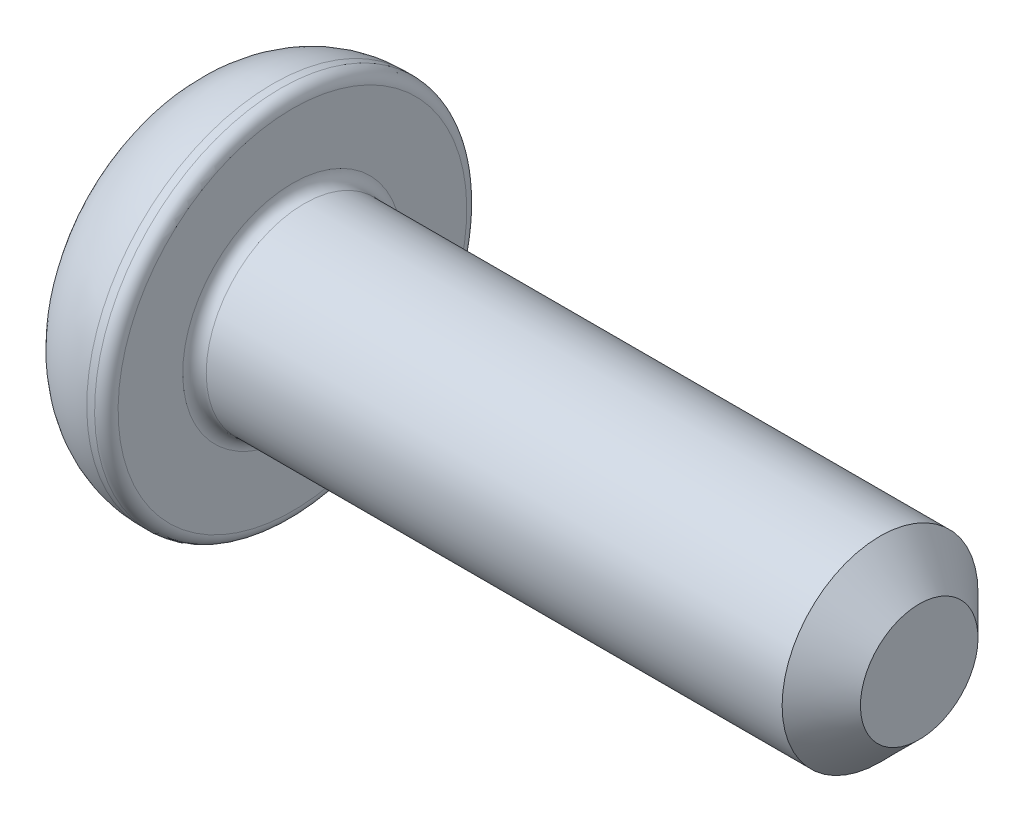
ISO-10303-21;
HEADER;
FILE_DESCRIPTION(('STEP AP214'),'2;1');
FILE_NAME('part.step','',(''),(''),'','','');
FILE_SCHEMA(('AUTOMOTIVE_DESIGN { 1 0 10303 214 1 1 1 1 }'));
ENDSEC;
DATA;
#1=APPLICATION_CONTEXT('core data for automotive mechanical design processes');
#2=APPLICATION_PROTOCOL_DEFINITION('international standard','automotive_design',2000,#1);
#3=PRODUCT_CONTEXT('',#1,'mechanical');
#4=PRODUCT('Part','Part','',(#3));
#5=PRODUCT_RELATED_PRODUCT_CATEGORY('part','',(#4));
#6=PRODUCT_DEFINITION_FORMATION('','',#4);
#7=PRODUCT_DEFINITION_CONTEXT('part definition',#1,'design');
#8=PRODUCT_DEFINITION('design','',#6,#7);
#9=PRODUCT_DEFINITION_SHAPE('','',#8);
#10=(LENGTH_UNIT() NAMED_UNIT(*) SI_UNIT(.MILLI.,.METRE.));
#11=(NAMED_UNIT(*) PLANE_ANGLE_UNIT() SI_UNIT($,.RADIAN.));
#12=(NAMED_UNIT(*) SI_UNIT($,.STERADIAN.) SOLID_ANGLE_UNIT());
#13=UNCERTAINTY_MEASURE_WITH_UNIT(LENGTH_MEASURE(1.E-05),#10,'distance_accuracy_value','');
#14=(GEOMETRIC_REPRESENTATION_CONTEXT(3) GLOBAL_UNCERTAINTY_ASSIGNED_CONTEXT((#13)) GLOBAL_UNIT_ASSIGNED_CONTEXT((#10,
#11,#12)) REPRESENTATION_CONTEXT('',''));
#15=CARTESIAN_POINT('',(0.,0.,0.));
#16=DIRECTION('',(0.,0.,1.));
#17=DIRECTION('',(1.,0.,0.));
#18=AXIS2_PLACEMENT_3D('',#15,#16,#17);
#19=CARTESIAN_POINT('',(0.,0.,0.));
#20=DIRECTION('',(-1.,0.,0.));
#21=DIRECTION('',(0.,-1.,0.));
#22=AXIS2_PLACEMENT_3D('',#19,#20,#21);
#23=PLANE('',#22);
#24=DIRECTION('',(0.,0.866025403784438,-0.5));
#25=VECTOR('',#24,1.);
#26=CARTESIAN_POINT('',(0.,0.,1.73205080756888));
#27=LINE('',#26,#25);
#28=CARTESIAN_POINT('',(0.,0.,1.73205080756888));
#29=VERTEX_POINT('',#28);
#30=CARTESIAN_POINT('',(0.,1.5,0.866025403784438));
#31=VERTEX_POINT('',#30);
#32=EDGE_CURVE('E55',#29,#31,#27,.T.);
#33=ORIENTED_EDGE('',*,*,#32,.F.);
#34=DIRECTION('',(0.,0.866025403784439,0.5));
#35=VECTOR('',#34,1.);
#36=CARTESIAN_POINT('',(0.,-1.5,0.866025403784438));
#37=LINE('',#36,#35);
#38=CARTESIAN_POINT('',(0.,-1.5,0.866025403784438));
#39=VERTEX_POINT('',#38);
#40=EDGE_CURVE('E138',#39,#29,#37,.T.);
#41=ORIENTED_EDGE('',*,*,#40,.F.);
#42=DIRECTION('',(0.,0.,1.));
#43=VECTOR('',#42,1.);
#44=CARTESIAN_POINT('',(0.,-1.5,-0.866025403784439));
#45=LINE('',#44,#43);
#46=CARTESIAN_POINT('',(0.,-1.5,-0.866025403784439));
#47=VERTEX_POINT('',#46);
#48=EDGE_CURVE('E136',#47,#39,#45,.T.);
#49=ORIENTED_EDGE('',*,*,#48,.F.);
#50=DIRECTION('',(0.,-0.866025403784438,0.5));
#51=VECTOR('',#50,1.);
#52=CARTESIAN_POINT('',(0.,0.,-1.73205080756888));
#53=LINE('',#52,#51);
#54=CARTESIAN_POINT('',(0.,0.,-1.73205080756888));
#55=VERTEX_POINT('',#54);
#56=EDGE_CURVE('E103',#55,#47,#53,.T.);
#57=ORIENTED_EDGE('',*,*,#56,.F.);
#58=DIRECTION('',(0.,-0.866025403784439,-0.5));
#59=VECTOR('',#58,1.);
#60=CARTESIAN_POINT('',(0.,1.5,-0.866025403784439));
#61=LINE('',#60,#59);
#62=CARTESIAN_POINT('',(0.,1.5,-0.866025403784439));
#63=VERTEX_POINT('',#62);
#64=EDGE_CURVE('E132',#63,#55,#61,.T.);
#65=ORIENTED_EDGE('',*,*,#64,.F.);
#66=DIRECTION('',(0.,0.,-1.));
#67=VECTOR('',#66,1.);
#68=CARTESIAN_POINT('',(0.,1.5,0.866025403784438));
#69=LINE('',#68,#67);
#70=EDGE_CURVE('E129',#31,#63,#69,.T.);
#71=ORIENTED_EDGE('',*,*,#70,.F.);
#72=EDGE_LOOP('',(#33,#41,#49,#57,#65,#71));
#73=FACE_BOUND('',#72,.T.);
#74=CARTESIAN_POINT('',(0.,0.,0.));
#75=DIRECTION('',(1.,0.,0.));
#76=DIRECTION('',(0.,1.,0.));
#77=AXIS2_PLACEMENT_3D('',#74,#75,#76);
#78=CIRCLE('',#77,3.625);
#79=CARTESIAN_POINT('',(0.,3.625,0.));
#80=VERTEX_POINT('',#79);
#81=EDGE_CURVE('E150',#80,#80,#78,.T.);
#82=ORIENTED_EDGE('',*,*,#81,.F.);
#83=EDGE_LOOP('',(#82));
#84=FACE_BOUND('',#83,.T.);
#85=ADVANCED_FACE('F39',(#73,#84),#23,.T.);
#86=CARTESIAN_POINT('',(2.1,0.,0.));
#87=DIRECTION('',(1.,0.,0.));
#88=DIRECTION('',(0.,1.,0.));
#89=AXIS2_PLACEMENT_3D('',#86,#87,#88);
#90=DEGENERATE_TOROIDAL_SURFACE('',#89,2.2275,2.5225,.T.);
#91=ORIENTED_EDGE('',*,*,#81,.T.);
#92=EDGE_LOOP('',(#91));
#93=FACE_BOUND('',#92,.T.);
#94=CARTESIAN_POINT('',(2.1,0.,0.));
#95=DIRECTION('',(1.,0.,0.));
#96=DIRECTION('',(0.,1.,0.));
#97=AXIS2_PLACEMENT_3D('',#94,#95,#96);
#98=CIRCLE('',#97,4.75);
#99=CARTESIAN_POINT('',(2.1,4.75,0.));
#100=VERTEX_POINT('',#99);
#101=EDGE_CURVE('E142',#100,#100,#98,.T.);
#102=ORIENTED_EDGE('',*,*,#101,.F.);
#103=EDGE_LOOP('',(#102));
#104=FACE_BOUND('',#103,.T.);
#105=ADVANCED_FACE('F179',(#93,#104),#90,.T.);
#106=CARTESIAN_POINT('',(18.6,0.,0.));
#107=DIRECTION('',(1.,0.,0.));
#108=DIRECTION('',(0.,1.,0.));
#109=AXIS2_PLACEMENT_3D('',#106,#107,#108);
#110=CYLINDRICAL_SURFACE('',#109,4.75);
#111=CARTESIAN_POINT('',(2.3,0.,0.));
#112=DIRECTION('',(1.,0.,0.));
#113=DIRECTION('',(0.,1.,0.));
#114=AXIS2_PLACEMENT_3D('',#111,#112,#113);
#115=CIRCLE('',#114,4.75);
#116=CARTESIAN_POINT('',(2.3,4.75,0.));
#117=VERTEX_POINT('',#116);
#118=EDGE_CURVE('E162',#117,#117,#115,.F.);
#119=ORIENTED_EDGE('',*,*,#118,.T.);
#120=EDGE_LOOP('',(#119));
#121=FACE_BOUND('',#120,.T.);
#122=ORIENTED_EDGE('',*,*,#101,.T.);
#123=EDGE_LOOP('',(#122));
#124=FACE_BOUND('',#123,.T.);
#125=ADVANCED_FACE('F185',(#121,#124),#110,.T.);
#126=CARTESIAN_POINT('',(2.6,4.75,0.));
#127=DIRECTION('',(1.,0.,0.));
#128=DIRECTION('',(0.,1.,0.));
#129=AXIS2_PLACEMENT_3D('',#126,#127,#128);
#130=PLANE('',#129);
#131=CARTESIAN_POINT('',(2.6,0.,0.));
#132=DIRECTION('',(1.,0.,0.));
#133=DIRECTION('',(0.,1.,0.));
#134=AXIS2_PLACEMENT_3D('',#131,#132,#133);
#135=CIRCLE('',#134,2.8);
#136=CARTESIAN_POINT('',(2.6,2.8,0.));
#137=VERTEX_POINT('',#136);
#138=EDGE_CURVE('E159',#137,#137,#135,.F.);
#139=ORIENTED_EDGE('',*,*,#138,.T.);
#140=EDGE_LOOP('',(#139));
#141=FACE_BOUND('',#140,.T.);
#142=CARTESIAN_POINT('',(2.6,0.,0.));
#143=DIRECTION('',(1.,0.,0.));
#144=DIRECTION('',(0.,1.,0.));
#145=AXIS2_PLACEMENT_3D('',#142,#143,#144);
#146=CIRCLE('',#145,4.45);
#147=CARTESIAN_POINT('',(2.6,4.45,0.));
#148=VERTEX_POINT('',#147);
#149=EDGE_CURVE('E156',#148,#148,#146,.T.);
#150=ORIENTED_EDGE('',*,*,#149,.T.);
#151=EDGE_LOOP('',(#150));
#152=FACE_BOUND('',#151,.T.);
#153=ADVANCED_FACE('F204',(#141,#152),#130,.T.);
#154=CARTESIAN_POINT('',(18.6,0.,0.));
#155=DIRECTION('',(1.,0.,0.));
#156=DIRECTION('',(0.,1.,0.));
#157=AXIS2_PLACEMENT_3D('',#154,#155,#156);
#158=CYLINDRICAL_SURFACE('',#157,2.5);
#159=CARTESIAN_POINT('',(17.6,0.,0.));
#160=DIRECTION('',(1.,0.,0.));
#161=DIRECTION('',(0.,1.,0.));
#162=AXIS2_PLACEMENT_3D('',#159,#160,#161);
#163=CIRCLE('',#162,2.5);
#164=CARTESIAN_POINT('',(17.6,2.5,0.));
#165=VERTEX_POINT('',#164);
#166=EDGE_CURVE('E11',#165,#165,#163,.F.);
#167=ORIENTED_EDGE('',*,*,#166,.T.);
#168=EDGE_LOOP('',(#167));
#169=FACE_BOUND('',#168,.T.);
#170=CARTESIAN_POINT('',(2.9,0.,0.));
#171=DIRECTION('',(1.,0.,0.));
#172=DIRECTION('',(0.,1.,0.));
#173=AXIS2_PLACEMENT_3D('',#170,#171,#172);
#174=CIRCLE('',#173,2.5);
#175=CARTESIAN_POINT('',(2.9,2.5,0.));
#176=VERTEX_POINT('',#175);
#177=EDGE_CURVE('E153',#176,#176,#174,.T.);
#178=ORIENTED_EDGE('',*,*,#177,.T.);
#179=EDGE_LOOP('',(#178));
#180=FACE_BOUND('',#179,.T.);
#181=ADVANCED_FACE('F202',(#169,#180),#158,.T.);
#182=CARTESIAN_POINT('',(18.6,2.5,0.));
#183=DIRECTION('',(1.,0.,0.));
#184=DIRECTION('',(0.,1.,0.));
#185=AXIS2_PLACEMENT_3D('',#182,#183,#184);
#186=PLANE('',#185);
#187=CARTESIAN_POINT('',(18.6,0.,0.));
#188=DIRECTION('',(1.,0.,0.));
#189=DIRECTION('',(0.,1.,0.));
#190=AXIS2_PLACEMENT_3D('',#187,#188,#189);
#191=CIRCLE('',#190,1.49999999999999);
#192=CARTESIAN_POINT('',(18.6,1.5,0.));
#193=VERTEX_POINT('',#192);
#194=EDGE_CURVE('E48',#193,#193,#191,.T.);
#195=ORIENTED_EDGE('',*,*,#194,.T.);
#196=EDGE_LOOP('',(#195));
#197=FACE_BOUND('',#196,.T.);
#198=ADVANCED_FACE('F167',(#197),#186,.T.);
#199=CARTESIAN_POINT('',(1.5,0.,1.73205080756888));
#200=DIRECTION('',(0.,0.5,0.866025403784439));
#201=DIRECTION('',(0.,-0.866025403784439,0.5));
#202=AXIS2_PLACEMENT_3D('',#199,#200,#201);
#203=PLANE('',#202);
#204=ORIENTED_EDGE('',*,*,#32,.T.);
#205=DIRECTION('',(-1.,0.,0.));
#206=VECTOR('',#205,1.);
#207=CARTESIAN_POINT('',(1.5,1.5,0.866025403784438));
#208=LINE('',#207,#206);
#209=CARTESIAN_POINT('',(1.5,1.5,0.866025403784438));
#210=VERTEX_POINT('',#209);
#211=EDGE_CURVE('E85',#210,#31,#208,.T.);
#212=ORIENTED_EDGE('',*,*,#211,.F.);
#213=DIRECTION('',(0.,0.866025403784438,-0.5));
#214=VECTOR('',#213,1.);
#215=CARTESIAN_POINT('',(1.5,0.,1.73205080756888));
#216=LINE('',#215,#214);
#217=CARTESIAN_POINT('',(1.5,0.,1.73205080756888));
#218=VERTEX_POINT('',#217);
#219=EDGE_CURVE('E140',#218,#210,#216,.T.);
#220=ORIENTED_EDGE('',*,*,#219,.F.);
#221=DIRECTION('',(-1.,0.,0.));
#222=VECTOR('',#221,1.);
#223=CARTESIAN_POINT('',(1.5,0.,1.73205080756888));
#224=LINE('',#223,#222);
#225=EDGE_CURVE('E63',#218,#29,#224,.T.);
#226=ORIENTED_EDGE('',*,*,#225,.T.);
#227=EDGE_LOOP('',(#204,#212,#220,#226));
#228=FACE_BOUND('',#227,.T.);
#229=ADVANCED_FACE('F211',(#228),#203,.F.);
#230=CARTESIAN_POINT('',(1.5,-1.5,0.866025403784438));
#231=DIRECTION('',(0.,-0.5,0.866025403784438));
#232=DIRECTION('',(0.,-0.866025403784439,-0.5));
#233=AXIS2_PLACEMENT_3D('',#230,#231,#232);
#234=PLANE('',#233);
#235=ORIENTED_EDGE('',*,*,#40,.T.);
#236=ORIENTED_EDGE('',*,*,#225,.F.);
#237=DIRECTION('',(0.,0.866025403784439,0.5));
#238=VECTOR('',#237,1.);
#239=CARTESIAN_POINT('',(1.5,-1.5,0.866025403784438));
#240=LINE('',#239,#238);
#241=CARTESIAN_POINT('',(1.5,-1.5,0.866025403784438));
#242=VERTEX_POINT('',#241);
#243=EDGE_CURVE('E115',#242,#218,#240,.T.);
#244=ORIENTED_EDGE('',*,*,#243,.F.);
#245=DIRECTION('',(-1.,0.,0.));
#246=VECTOR('',#245,1.);
#247=CARTESIAN_POINT('',(1.5,-1.5,0.866025403784438));
#248=LINE('',#247,#246);
#249=EDGE_CURVE('E107',#242,#39,#248,.T.);
#250=ORIENTED_EDGE('',*,*,#249,.T.);
#251=EDGE_LOOP('',(#235,#236,#244,#250));
#252=FACE_BOUND('',#251,.T.);
#253=ADVANCED_FACE('F270',(#252),#234,.F.);
#254=CARTESIAN_POINT('',(1.5,-1.5,-0.866025403784439));
#255=DIRECTION('',(0.,-1.,0.));
#256=DIRECTION('',(0.,0.,-1.));
#257=AXIS2_PLACEMENT_3D('',#254,#255,#256);
#258=PLANE('',#257);
#259=ORIENTED_EDGE('',*,*,#48,.T.);
#260=ORIENTED_EDGE('',*,*,#249,.F.);
#261=DIRECTION('',(0.,0.,1.));
#262=VECTOR('',#261,1.);
#263=CARTESIAN_POINT('',(1.5,-1.5,-0.866025403784439));
#264=LINE('',#263,#262);
#265=CARTESIAN_POINT('',(1.5,-1.5,-0.866025403784439));
#266=VERTEX_POINT('',#265);
#267=EDGE_CURVE('E111',#266,#242,#264,.T.);
#268=ORIENTED_EDGE('',*,*,#267,.F.);
#269=DIRECTION('',(-1.,0.,0.));
#270=VECTOR('',#269,1.);
#271=CARTESIAN_POINT('',(1.5,-1.5,-0.866025403784439));
#272=LINE('',#271,#270);
#273=EDGE_CURVE('E96',#266,#47,#272,.T.);
#274=ORIENTED_EDGE('',*,*,#273,.T.);
#275=EDGE_LOOP('',(#259,#260,#268,#274));
#276=FACE_BOUND('',#275,.T.);
#277=ADVANCED_FACE('F112',(#276),#258,.F.);
#278=CARTESIAN_POINT('',(1.5,0.,-1.73205080756888));
#279=DIRECTION('',(0.,-0.5,-0.866025403784439));
#280=DIRECTION('',(0.,0.866025403784439,-0.5));
#281=AXIS2_PLACEMENT_3D('',#278,#279,#280);
#282=PLANE('',#281);
#283=ORIENTED_EDGE('',*,*,#56,.T.);
#284=ORIENTED_EDGE('',*,*,#273,.F.);
#285=DIRECTION('',(0.,-0.866025403784438,0.5));
#286=VECTOR('',#285,1.);
#287=CARTESIAN_POINT('',(1.5,0.,-1.73205080756888));
#288=LINE('',#287,#286);
#289=CARTESIAN_POINT('',(1.5,0.,-1.73205080756888));
#290=VERTEX_POINT('',#289);
#291=EDGE_CURVE('E100',#290,#266,#288,.T.);
#292=ORIENTED_EDGE('',*,*,#291,.F.);
#293=DIRECTION('',(-1.,0.,0.));
#294=VECTOR('',#293,1.);
#295=CARTESIAN_POINT('',(1.5,0.,-1.73205080756888));
#296=LINE('',#295,#294);
#297=EDGE_CURVE('E108',#290,#55,#296,.T.);
#298=ORIENTED_EDGE('',*,*,#297,.T.);
#299=EDGE_LOOP('',(#283,#284,#292,#298));
#300=FACE_BOUND('',#299,.T.);
#301=ADVANCED_FACE('F98',(#300),#282,.F.);
#302=CARTESIAN_POINT('',(1.5,1.5,-0.866025403784439));
#303=DIRECTION('',(0.,0.5,-0.866025403784439));
#304=DIRECTION('',(0.,0.866025403784439,0.5));
#305=AXIS2_PLACEMENT_3D('',#302,#303,#304);
#306=PLANE('',#305);
#307=ORIENTED_EDGE('',*,*,#64,.T.);
#308=ORIENTED_EDGE('',*,*,#297,.F.);
#309=DIRECTION('',(0.,-0.866025403784439,-0.5));
#310=VECTOR('',#309,1.);
#311=CARTESIAN_POINT('',(1.5,1.5,-0.866025403784439));
#312=LINE('',#311,#310);
#313=CARTESIAN_POINT('',(1.5,1.5,-0.866025403784439));
#314=VERTEX_POINT('',#313);
#315=EDGE_CURVE('E121',#314,#290,#312,.T.);
#316=ORIENTED_EDGE('',*,*,#315,.F.);
#317=DIRECTION('',(-1.,0.,0.));
#318=VECTOR('',#317,1.);
#319=CARTESIAN_POINT('',(1.5,1.5,-0.866025403784439));
#320=LINE('',#319,#318);
#321=EDGE_CURVE('E145',#314,#63,#320,.T.);
#322=ORIENTED_EDGE('',*,*,#321,.T.);
#323=EDGE_LOOP('',(#307,#308,#316,#322));
#324=FACE_BOUND('',#323,.T.);
#325=ADVANCED_FACE('F287',(#324),#306,.F.);
#326=CARTESIAN_POINT('',(1.5,1.5,0.866025403784438));
#327=DIRECTION('',(0.,1.,0.));
#328=DIRECTION('',(0.,0.,1.));
#329=AXIS2_PLACEMENT_3D('',#326,#327,#328);
#330=PLANE('',#329);
#331=ORIENTED_EDGE('',*,*,#70,.T.);
#332=ORIENTED_EDGE('',*,*,#321,.F.);
#333=DIRECTION('',(0.,0.,-1.));
#334=VECTOR('',#333,1.);
#335=CARTESIAN_POINT('',(1.5,1.5,0.866025403784438));
#336=LINE('',#335,#334);
#337=EDGE_CURVE('E123',#210,#314,#336,.T.);
#338=ORIENTED_EDGE('',*,*,#337,.F.);
#339=ORIENTED_EDGE('',*,*,#211,.T.);
#340=EDGE_LOOP('',(#331,#332,#338,#339));
#341=FACE_BOUND('',#340,.T.);
#342=ADVANCED_FACE('F196',(#341),#330,.F.);
#343=CARTESIAN_POINT('',(1.5,0.,0.));
#344=DIRECTION('',(-1.,0.,0.));
#345=DIRECTION('',(0.,0.,1.));
#346=AXIS2_PLACEMENT_3D('',#343,#344,#345);
#347=PLANE('',#346);
#348=ORIENTED_EDGE('',*,*,#219,.T.);
#349=ORIENTED_EDGE('',*,*,#337,.T.);
#350=ORIENTED_EDGE('',*,*,#315,.T.);
#351=ORIENTED_EDGE('',*,*,#291,.T.);
#352=ORIENTED_EDGE('',*,*,#267,.T.);
#353=ORIENTED_EDGE('',*,*,#243,.T.);
#354=EDGE_LOOP('',(#348,#349,#350,#351,#352,#353));
#355=FACE_BOUND('',#354,.T.);
#356=ADVANCED_FACE('F118',(#355),#347,.T.);
#357=CARTESIAN_POINT('',(2.9,0.,0.));
#358=DIRECTION('',(1.,0.,0.));
#359=DIRECTION('',(0.,1.,0.));
#360=AXIS2_PLACEMENT_3D('',#357,#358,#359);
#361=TOROIDAL_SURFACE('',#360,2.8,0.3);
#362=ORIENTED_EDGE('',*,*,#138,.F.);
#363=EDGE_LOOP('',(#362));
#364=FACE_BOUND('',#363,.T.);
#365=ORIENTED_EDGE('',*,*,#177,.F.);
#366=EDGE_LOOP('',(#365));
#367=FACE_BOUND('',#366,.T.);
#368=ADVANCED_FACE('F175',(#364,#367),#361,.F.);
#369=CARTESIAN_POINT('',(2.3,0.,0.));
#370=DIRECTION('',(1.,0.,0.));
#371=DIRECTION('',(0.,1.,0.));
#372=AXIS2_PLACEMENT_3D('',#369,#370,#371);
#373=TOROIDAL_SURFACE('',#372,4.45,0.3);
#374=ORIENTED_EDGE('',*,*,#118,.F.);
#375=EDGE_LOOP('',(#374));
#376=FACE_BOUND('',#375,.T.);
#377=ORIENTED_EDGE('',*,*,#149,.F.);
#378=EDGE_LOOP('',(#377));
#379=FACE_BOUND('',#378,.T.);
#380=ADVANCED_FACE('F170',(#376,#379),#373,.T.);
#381=CARTESIAN_POINT('',(18.6,0.,0.));
#382=DIRECTION('',(-1.,0.,0.));
#383=DIRECTION('',(0.,-1.,0.));
#384=AXIS2_PLACEMENT_3D('',#381,#382,#383);
#385=CONICAL_SURFACE('',#384,1.49999999999999,0.785398163397447);
#386=ORIENTED_EDGE('',*,*,#166,.F.);
#387=EDGE_LOOP('',(#386));
#388=FACE_BOUND('',#387,.T.);
#389=ORIENTED_EDGE('',*,*,#194,.F.);
#390=EDGE_LOOP('',(#389));
#391=FACE_BOUND('',#390,.T.);
#392=ADVANCED_FACE('F42',(#388,#391),#385,.T.);
#393=CLOSED_SHELL('',(#85,#105,#125,#153,#181,#198,#229,#253,#277,#301,#325,#342,#356,#368,#380,#392));
#394=MANIFOLD_SOLID_BREP('B2',#393);
#395=ADVANCED_BREP_SHAPE_REPRESENTATION('',(#18,#394),#14);
#396=SHAPE_DEFINITION_REPRESENTATION(#9,#395);
ENDSEC;
END-ISO-10303-21;
